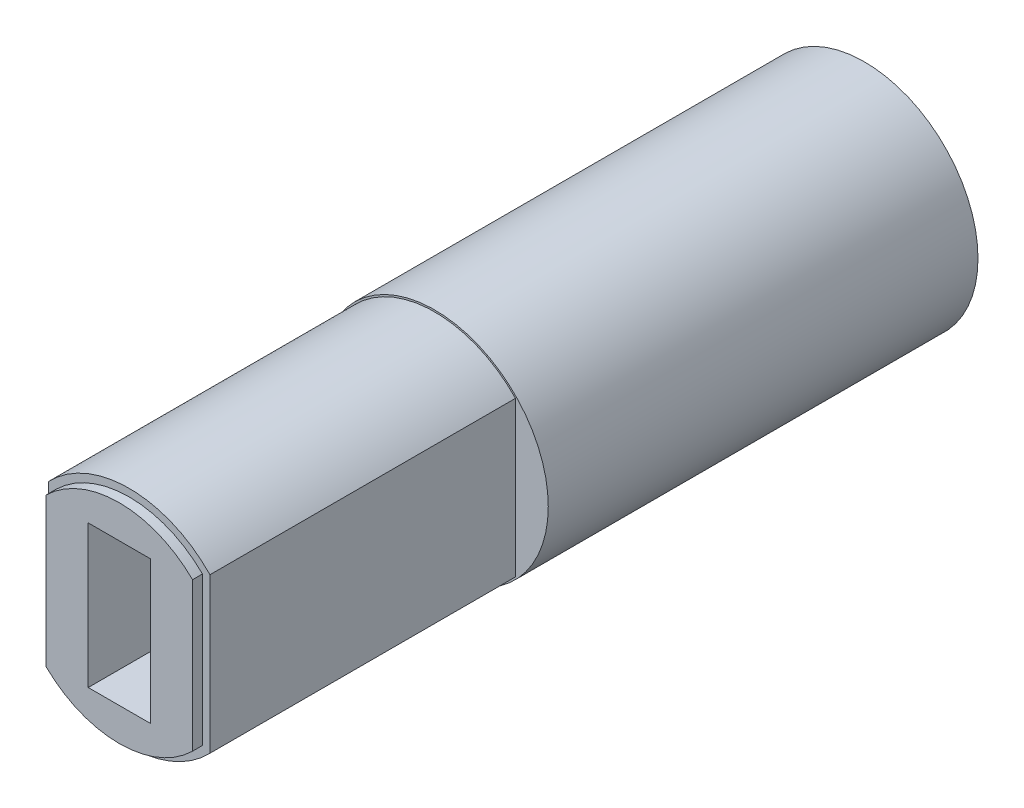
ISO-10303-21;
HEADER;
FILE_DESCRIPTION(('STEP AP214'),'2;1');
FILE_NAME('part.step','',(''),(''),'','','');
FILE_SCHEMA(('AUTOMOTIVE_DESIGN { 1 0 10303 214 1 1 1 1 }'));
ENDSEC;
DATA;
#1=APPLICATION_CONTEXT('core data for automotive mechanical design processes');
#2=APPLICATION_PROTOCOL_DEFINITION('international standard','automotive_design',2000,#1);
#3=PRODUCT_CONTEXT('',#1,'mechanical');
#4=PRODUCT('Part','Part','',(#3));
#5=PRODUCT_RELATED_PRODUCT_CATEGORY('part','',(#4));
#6=PRODUCT_DEFINITION_FORMATION('','',#4);
#7=PRODUCT_DEFINITION_CONTEXT('part definition',#1,'design');
#8=PRODUCT_DEFINITION('design','',#6,#7);
#9=PRODUCT_DEFINITION_SHAPE('','',#8);
#10=(LENGTH_UNIT() NAMED_UNIT(*) SI_UNIT(.MILLI.,.METRE.));
#11=(NAMED_UNIT(*) PLANE_ANGLE_UNIT() SI_UNIT($,.RADIAN.));
#12=(NAMED_UNIT(*) SI_UNIT($,.STERADIAN.) SOLID_ANGLE_UNIT());
#13=UNCERTAINTY_MEASURE_WITH_UNIT(LENGTH_MEASURE(1.E-05),#10,'distance_accuracy_value','');
#14=(GEOMETRIC_REPRESENTATION_CONTEXT(3) GLOBAL_UNCERTAINTY_ASSIGNED_CONTEXT((#13)) GLOBAL_UNIT_ASSIGNED_CONTEXT((#10,
#11,#12)) REPRESENTATION_CONTEXT('',''));
#15=CARTESIAN_POINT('',(0.,0.,0.));
#16=DIRECTION('',(0.,0.,1.));
#17=DIRECTION('',(1.,0.,0.));
#18=AXIS2_PLACEMENT_3D('',#15,#16,#17);
#19=CARTESIAN_POINT('',(0.,0.,71.1018016555873));
#20=DIRECTION('',(0.,0.,-1.));
#21=DIRECTION('',(-1.,0.,0.));
#22=AXIS2_PLACEMENT_3D('',#19,#20,#21);
#23=CYLINDRICAL_SURFACE('',#22,4.5);
#24=CARTESIAN_POINT('',(0.,0.,29.6));
#25=DIRECTION('',(0.,0.,1.));
#26=DIRECTION('',(1.,0.,0.));
#27=AXIS2_PLACEMENT_3D('',#24,#25,#26);
#28=CIRCLE('',#27,4.5);
#29=CARTESIAN_POINT('',(3.25,3.11247489949718,29.6));
#30=VERTEX_POINT('',#29);
#31=CARTESIAN_POINT('',(-3.25,3.11247489949718,29.6));
#32=VERTEX_POINT('',#31);
#33=EDGE_CURVE('E134',#30,#32,#28,.T.);
#34=ORIENTED_EDGE('',*,*,#33,.F.);
#35=DIRECTION('',(0.,0.,-1.));
#36=VECTOR('',#35,1.);
#37=CARTESIAN_POINT('',(3.25,3.11247489949719,71.1018016555873));
#38=LINE('',#37,#36);
#39=CARTESIAN_POINT('',(3.25,3.11247489949718,17.3));
#40=VERTEX_POINT('',#39);
#41=EDGE_CURVE('E145',#30,#40,#38,.T.);
#42=ORIENTED_EDGE('',*,*,#41,.T.);
#43=CARTESIAN_POINT('',(0.,0.,17.3));
#44=DIRECTION('',(0.,0.,1.));
#45=DIRECTION('',(1.,0.,0.));
#46=AXIS2_PLACEMENT_3D('',#43,#44,#45);
#47=CIRCLE('',#46,4.5);
#48=CARTESIAN_POINT('',(-3.25,3.11247489949718,17.3));
#49=VERTEX_POINT('',#48);
#50=EDGE_CURVE('E156',#40,#49,#47,.T.);
#51=ORIENTED_EDGE('',*,*,#50,.T.);
#52=DIRECTION('',(0.,0.,-1.));
#53=VECTOR('',#52,1.);
#54=CARTESIAN_POINT('',(-3.25,3.11247489949718,71.1018016555873));
#55=LINE('',#54,#53);
#56=EDGE_CURVE('E147',#32,#49,#55,.T.);
#57=ORIENTED_EDGE('',*,*,#56,.F.);
#58=EDGE_LOOP('',(#34,#42,#51,#57));
#59=FACE_BOUND('',#58,.T.);
#60=ADVANCED_FACE('F42',(#59),#23,.T.);
#61=CARTESIAN_POINT('',(-3.25,3.11247489949718,71.1018016555873));
#62=DIRECTION('',(1.,0.,0.));
#63=DIRECTION('',(0.,0.,-1.));
#64=AXIS2_PLACEMENT_3D('',#61,#62,#63);
#65=PLANE('',#64);
#66=DIRECTION('',(0.,-1.,0.));
#67=VECTOR('',#66,1.);
#68=CARTESIAN_POINT('',(-3.25,0.,29.6));
#69=LINE('',#68,#67);
#70=CARTESIAN_POINT('',(-3.25000000000001,-3.11247489949718,29.6));
#71=VERTEX_POINT('',#70);
#72=EDGE_CURVE('E149',#32,#71,#69,.T.);
#73=ORIENTED_EDGE('',*,*,#72,.F.);
#74=ORIENTED_EDGE('',*,*,#56,.T.);
#75=DIRECTION('',(0.,-1.,0.));
#76=VECTOR('',#75,1.);
#77=CARTESIAN_POINT('',(-3.25,3.11247489949718,17.3));
#78=LINE('',#77,#76);
#79=CARTESIAN_POINT('',(-3.25,-3.11247489949718,17.3));
#80=VERTEX_POINT('',#79);
#81=EDGE_CURVE('E173',#49,#80,#78,.T.);
#82=ORIENTED_EDGE('',*,*,#81,.T.);
#83=DIRECTION('',(0.,0.,-1.));
#84=VECTOR('',#83,1.);
#85=CARTESIAN_POINT('',(-3.25,-3.11247489949718,71.1018016555872));
#86=LINE('',#85,#84);
#87=EDGE_CURVE('E170',#71,#80,#86,.T.);
#88=ORIENTED_EDGE('',*,*,#87,.F.);
#89=EDGE_LOOP('',(#73,#74,#82,#88));
#90=FACE_BOUND('',#89,.T.);
#91=ADVANCED_FACE('F272',(#90),#65,.F.);
#92=CARTESIAN_POINT('',(0.,0.,71.1018016555873));
#93=DIRECTION('',(0.,0.,-1.));
#94=DIRECTION('',(-1.,0.,0.));
#95=AXIS2_PLACEMENT_3D('',#92,#93,#94);
#96=CYLINDRICAL_SURFACE('',#95,4.5);
#97=CARTESIAN_POINT('',(0.,0.,29.6));
#98=DIRECTION('',(0.,0.,1.));
#99=DIRECTION('',(1.,0.,0.));
#100=AXIS2_PLACEMENT_3D('',#97,#98,#99);
#101=CIRCLE('',#100,4.5);
#102=CARTESIAN_POINT('',(3.25,-3.11247489949718,29.6));
#103=VERTEX_POINT('',#102);
#104=EDGE_CURVE('E58',#71,#103,#101,.T.);
#105=ORIENTED_EDGE('',*,*,#104,.F.);
#106=ORIENTED_EDGE('',*,*,#87,.T.);
#107=CARTESIAN_POINT('',(0.,0.,17.3));
#108=DIRECTION('',(0.,0.,1.));
#109=DIRECTION('',(1.,0.,0.));
#110=AXIS2_PLACEMENT_3D('',#107,#108,#109);
#111=CIRCLE('',#110,4.5);
#112=CARTESIAN_POINT('',(3.25,-3.11247489949718,17.3));
#113=VERTEX_POINT('',#112);
#114=EDGE_CURVE('E169',#80,#113,#111,.T.);
#115=ORIENTED_EDGE('',*,*,#114,.T.);
#116=DIRECTION('',(0.,0.,-1.));
#117=VECTOR('',#116,1.);
#118=CARTESIAN_POINT('',(3.25,-3.11247489949718,71.1018016555873));
#119=LINE('',#118,#117);
#120=EDGE_CURVE('E166',#103,#113,#119,.T.);
#121=ORIENTED_EDGE('',*,*,#120,.F.);
#122=EDGE_LOOP('',(#105,#106,#115,#121));
#123=FACE_BOUND('',#122,.T.);
#124=ADVANCED_FACE('F270',(#123),#96,.T.);
#125=CARTESIAN_POINT('',(3.25,3.11247489949719,71.1018016555873));
#126=DIRECTION('',(-1.,0.,0.));
#127=DIRECTION('',(0.,0.,1.));
#128=AXIS2_PLACEMENT_3D('',#125,#126,#127);
#129=PLANE('',#128);
#130=DIRECTION('',(0.,1.,0.));
#131=VECTOR('',#130,1.);
#132=CARTESIAN_POINT('',(3.25,0.,29.6));
#133=LINE('',#132,#131);
#134=EDGE_CURVE('E130',#103,#30,#133,.T.);
#135=ORIENTED_EDGE('',*,*,#134,.F.);
#136=ORIENTED_EDGE('',*,*,#120,.T.);
#137=DIRECTION('',(0.,1.,0.));
#138=VECTOR('',#137,1.);
#139=CARTESIAN_POINT('',(3.25,3.11247489949718,17.3));
#140=LINE('',#139,#138);
#141=EDGE_CURVE('E154',#113,#40,#140,.T.);
#142=ORIENTED_EDGE('',*,*,#141,.T.);
#143=ORIENTED_EDGE('',*,*,#41,.F.);
#144=EDGE_LOOP('',(#135,#136,#142,#143));
#145=FACE_BOUND('',#144,.T.);
#146=ADVANCED_FACE('F152',(#145),#129,.F.);
#147=CARTESIAN_POINT('',(0.,0.,30.));
#148=DIRECTION('',(0.,0.,1.));
#149=DIRECTION('',(1.,0.,0.));
#150=AXIS2_PLACEMENT_3D('',#147,#148,#149);
#151=PLANE('',#150);
#152=DIRECTION('',(0.,-1.,0.));
#153=VECTOR('',#152,1.);
#154=CARTESIAN_POINT('',(-1.25,2.87,30.));
#155=LINE('',#154,#153);
#156=CARTESIAN_POINT('',(-1.25,2.87,30.));
#157=VERTEX_POINT('',#156);
#158=CARTESIAN_POINT('',(-1.25000000000001,-2.87,30.));
#159=VERTEX_POINT('',#158);
#160=EDGE_CURVE('E207',#157,#159,#155,.T.);
#161=ORIENTED_EDGE('',*,*,#160,.F.);
#162=DIRECTION('',(-1.,0.,0.));
#163=VECTOR('',#162,1.);
#164=CARTESIAN_POINT('',(-1.25,2.87,30.));
#165=LINE('',#164,#163);
#166=CARTESIAN_POINT('',(1.25,2.87,30.));
#167=VERTEX_POINT('',#166);
#168=EDGE_CURVE('E194',#167,#157,#165,.T.);
#169=ORIENTED_EDGE('',*,*,#168,.F.);
#170=DIRECTION('',(0.,1.,0.));
#171=VECTOR('',#170,1.);
#172=CARTESIAN_POINT('',(1.25,2.87,30.));
#173=LINE('',#172,#171);
#174=CARTESIAN_POINT('',(1.25,-2.87,30.));
#175=VERTEX_POINT('',#174);
#176=EDGE_CURVE('E199',#175,#167,#173,.T.);
#177=ORIENTED_EDGE('',*,*,#176,.F.);
#178=DIRECTION('',(1.,0.,0.));
#179=VECTOR('',#178,1.);
#180=CARTESIAN_POINT('',(-1.25000000000001,-2.87,30.));
#181=LINE('',#180,#179);
#182=EDGE_CURVE('E203',#159,#175,#181,.T.);
#183=ORIENTED_EDGE('',*,*,#182,.F.);
#184=EDGE_LOOP('',(#161,#169,#177,#183));
#185=FACE_BOUND('',#184,.T.);
#186=DIRECTION('',(0.,-1.,0.));
#187=VECTOR('',#186,1.);
#188=CARTESIAN_POINT('',(2.94999999999999,0.,30.));
#189=LINE('',#188,#187);
#190=CARTESIAN_POINT('',(2.94999999999999,2.98956518577534,30.));
#191=VERTEX_POINT('',#190);
#192=CARTESIAN_POINT('',(2.94999999999999,-2.98956518577535,30.));
#193=VERTEX_POINT('',#192);
#194=EDGE_CURVE('E244',#191,#193,#189,.T.);
#195=ORIENTED_EDGE('',*,*,#194,.F.);
#196=CARTESIAN_POINT('',(0.,0.,30.));
#197=DIRECTION('',(0.,0.,1.));
#198=DIRECTION('',(1.,0.,0.));
#199=AXIS2_PLACEMENT_3D('',#196,#197,#198);
#200=CIRCLE('',#199,4.2);
#201=CARTESIAN_POINT('',(-2.95000000000001,2.98956518577535,30.));
#202=VERTEX_POINT('',#201);
#203=EDGE_CURVE('E66',#191,#202,#200,.T.);
#204=ORIENTED_EDGE('',*,*,#203,.T.);
#205=DIRECTION('',(0.,-1.,0.));
#206=VECTOR('',#205,1.);
#207=CARTESIAN_POINT('',(-2.95,0.,30.));
#208=LINE('',#207,#206);
#209=CARTESIAN_POINT('',(-2.95,-2.98956518577535,30.));
#210=VERTEX_POINT('',#209);
#211=EDGE_CURVE('E140',#202,#210,#208,.T.);
#212=ORIENTED_EDGE('',*,*,#211,.T.);
#213=CARTESIAN_POINT('',(0.,0.,30.));
#214=DIRECTION('',(0.,0.,1.));
#215=DIRECTION('',(1.,0.,0.));
#216=AXIS2_PLACEMENT_3D('',#213,#214,#215);
#217=CIRCLE('',#216,4.2);
#218=EDGE_CURVE('E240',#210,#193,#217,.T.);
#219=ORIENTED_EDGE('',*,*,#218,.T.);
#220=EDGE_LOOP('',(#195,#204,#212,#219));
#221=FACE_BOUND('',#220,.T.);
#222=ADVANCED_FACE('F284',(#185,#221),#151,.T.);
#223=CARTESIAN_POINT('',(0.,0.,17.3));
#224=DIRECTION('',(0.,0.,-1.));
#225=DIRECTION('',(-1.,0.,0.));
#226=AXIS2_PLACEMENT_3D('',#223,#224,#225);
#227=CYLINDRICAL_SURFACE('',#226,4.57);
#228=CARTESIAN_POINT('',(0.,0.,17.3));
#229=DIRECTION('',(0.,0.,1.));
#230=DIRECTION('',(1.,0.,0.));
#231=AXIS2_PLACEMENT_3D('',#228,#229,#230);
#232=CIRCLE('',#231,4.57);
#233=CARTESIAN_POINT('',(4.57,0.,17.3));
#234=VERTEX_POINT('',#233);
#235=EDGE_CURVE('E12',#234,#234,#232,.T.);
#236=ORIENTED_EDGE('',*,*,#235,.F.);
#237=EDGE_LOOP('',(#236));
#238=FACE_BOUND('',#237,.T.);
#239=CARTESIAN_POINT('',(0.,0.,0.));
#240=DIRECTION('',(0.,0.,1.));
#241=DIRECTION('',(1.,0.,0.));
#242=AXIS2_PLACEMENT_3D('',#239,#240,#241);
#243=CIRCLE('',#242,4.57);
#244=CARTESIAN_POINT('',(4.57,0.,0.));
#245=VERTEX_POINT('',#244);
#246=EDGE_CURVE('E46',#245,#245,#243,.T.);
#247=ORIENTED_EDGE('',*,*,#246,.T.);
#248=EDGE_LOOP('',(#247));
#249=FACE_BOUND('',#248,.T.);
#250=ADVANCED_FACE('F44',(#238,#249),#227,.T.);
#251=CARTESIAN_POINT('',(0.,0.,17.3));
#252=DIRECTION('',(0.,0.,1.));
#253=DIRECTION('',(1.,0.,0.));
#254=AXIS2_PLACEMENT_3D('',#251,#252,#253);
#255=PLANE('',#254);
#256=ORIENTED_EDGE('',*,*,#50,.F.);
#257=ORIENTED_EDGE('',*,*,#141,.F.);
#258=ORIENTED_EDGE('',*,*,#114,.F.);
#259=ORIENTED_EDGE('',*,*,#81,.F.);
#260=EDGE_LOOP('',(#256,#257,#258,#259));
#261=FACE_BOUND('',#260,.T.);
#262=ORIENTED_EDGE('',*,*,#235,.T.);
#263=EDGE_LOOP('',(#262));
#264=FACE_BOUND('',#263,.T.);
#265=ADVANCED_FACE('F275',(#261,#264),#255,.T.);
#266=CARTESIAN_POINT('',(0.,0.,0.));
#267=DIRECTION('',(0.,0.,1.));
#268=DIRECTION('',(1.,0.,0.));
#269=AXIS2_PLACEMENT_3D('',#266,#267,#268);
#270=PLANE('',#269);
#271=DIRECTION('',(-1.,0.,0.));
#272=VECTOR('',#271,1.);
#273=CARTESIAN_POINT('',(-1.25,2.87,0.));
#274=LINE('',#273,#272);
#275=CARTESIAN_POINT('',(1.25,2.87,0.));
#276=VERTEX_POINT('',#275);
#277=CARTESIAN_POINT('',(-1.25,2.87,0.));
#278=VERTEX_POINT('',#277);
#279=EDGE_CURVE('E189',#276,#278,#274,.T.);
#280=ORIENTED_EDGE('',*,*,#279,.T.);
#281=DIRECTION('',(0.,-1.,0.));
#282=VECTOR('',#281,1.);
#283=CARTESIAN_POINT('',(-1.25,2.87,0.));
#284=LINE('',#283,#282);
#285=CARTESIAN_POINT('',(-1.25,-2.87,0.));
#286=VERTEX_POINT('',#285);
#287=EDGE_CURVE('E198',#278,#286,#284,.T.);
#288=ORIENTED_EDGE('',*,*,#287,.T.);
#289=DIRECTION('',(1.,0.,0.));
#290=VECTOR('',#289,1.);
#291=CARTESIAN_POINT('',(-1.25,-2.87,0.));
#292=LINE('',#291,#290);
#293=CARTESIAN_POINT('',(1.25,-2.87,0.));
#294=VERTEX_POINT('',#293);
#295=EDGE_CURVE('E218',#286,#294,#292,.T.);
#296=ORIENTED_EDGE('',*,*,#295,.T.);
#297=DIRECTION('',(0.,1.,0.));
#298=VECTOR('',#297,1.);
#299=CARTESIAN_POINT('',(1.25,2.87,0.));
#300=LINE('',#299,#298);
#301=EDGE_CURVE('E214',#294,#276,#300,.T.);
#302=ORIENTED_EDGE('',*,*,#301,.T.);
#303=EDGE_LOOP('',(#280,#288,#296,#302));
#304=FACE_BOUND('',#303,.T.);
#305=ORIENTED_EDGE('',*,*,#246,.F.);
#306=EDGE_LOOP('',(#305));
#307=FACE_BOUND('',#306,.T.);
#308=ADVANCED_FACE('F278',(#304,#307),#270,.F.);
#309=CARTESIAN_POINT('',(-1.25,2.87,0.));
#310=DIRECTION('',(-1.,0.,0.));
#311=DIRECTION('',(0.,0.,1.));
#312=AXIS2_PLACEMENT_3D('',#309,#310,#311);
#313=PLANE('',#312);
#314=ORIENTED_EDGE('',*,*,#160,.T.);
#315=DIRECTION('',(0.,0.,1.));
#316=VECTOR('',#315,1.);
#317=CARTESIAN_POINT('',(-1.25,-2.87,0.));
#318=LINE('',#317,#316);
#319=EDGE_CURVE('E184',#286,#159,#318,.T.);
#320=ORIENTED_EDGE('',*,*,#319,.F.);
#321=ORIENTED_EDGE('',*,*,#287,.F.);
#322=DIRECTION('',(0.,0.,1.));
#323=VECTOR('',#322,1.);
#324=CARTESIAN_POINT('',(-1.25,2.87,0.));
#325=LINE('',#324,#323);
#326=EDGE_CURVE('E157',#278,#157,#325,.T.);
#327=ORIENTED_EDGE('',*,*,#326,.T.);
#328=EDGE_LOOP('',(#314,#320,#321,#327));
#329=FACE_BOUND('',#328,.T.);
#330=ADVANCED_FACE('F299',(#329),#313,.F.);
#331=CARTESIAN_POINT('',(-1.25,2.87,0.));
#332=DIRECTION('',(0.,1.,0.));
#333=DIRECTION('',(0.,0.,1.));
#334=AXIS2_PLACEMENT_3D('',#331,#332,#333);
#335=PLANE('',#334);
#336=ORIENTED_EDGE('',*,*,#168,.T.);
#337=ORIENTED_EDGE('',*,*,#326,.F.);
#338=ORIENTED_EDGE('',*,*,#279,.F.);
#339=DIRECTION('',(0.,0.,1.));
#340=VECTOR('',#339,1.);
#341=CARTESIAN_POINT('',(1.25,2.87,0.));
#342=LINE('',#341,#340);
#343=EDGE_CURVE('E163',#276,#167,#342,.T.);
#344=ORIENTED_EDGE('',*,*,#343,.T.);
#345=EDGE_LOOP('',(#336,#337,#338,#344));
#346=FACE_BOUND('',#345,.T.);
#347=ADVANCED_FACE('F304',(#346),#335,.F.);
#348=CARTESIAN_POINT('',(1.25,2.87,0.));
#349=DIRECTION('',(1.,0.,0.));
#350=DIRECTION('',(0.,0.,-1.));
#351=AXIS2_PLACEMENT_3D('',#348,#349,#350);
#352=PLANE('',#351);
#353=ORIENTED_EDGE('',*,*,#176,.T.);
#354=ORIENTED_EDGE('',*,*,#343,.F.);
#355=ORIENTED_EDGE('',*,*,#301,.F.);
#356=DIRECTION('',(0.,0.,1.));
#357=VECTOR('',#356,1.);
#358=CARTESIAN_POINT('',(1.25,-2.87,0.));
#359=LINE('',#358,#357);
#360=EDGE_CURVE('E188',#294,#175,#359,.T.);
#361=ORIENTED_EDGE('',*,*,#360,.T.);
#362=EDGE_LOOP('',(#353,#354,#355,#361));
#363=FACE_BOUND('',#362,.T.);
#364=ADVANCED_FACE('F355',(#363),#352,.F.);
#365=CARTESIAN_POINT('',(-1.25,-2.87,0.));
#366=DIRECTION('',(0.,-1.,0.));
#367=DIRECTION('',(0.,0.,-1.));
#368=AXIS2_PLACEMENT_3D('',#365,#366,#367);
#369=PLANE('',#368);
#370=ORIENTED_EDGE('',*,*,#182,.T.);
#371=ORIENTED_EDGE('',*,*,#360,.F.);
#372=ORIENTED_EDGE('',*,*,#295,.F.);
#373=ORIENTED_EDGE('',*,*,#319,.T.);
#374=EDGE_LOOP('',(#370,#371,#372,#373));
#375=FACE_BOUND('',#374,.T.);
#376=ADVANCED_FACE('F352',(#375),#369,.F.);
#377=CARTESIAN_POINT('',(0.,0.,29.6));
#378=DIRECTION('',(0.,0.,1.));
#379=DIRECTION('',(1.,0.,0.));
#380=AXIS2_PLACEMENT_3D('',#377,#378,#379);
#381=CYLINDRICAL_SURFACE('',#380,4.2);
#382=ORIENTED_EDGE('',*,*,#203,.F.);
#383=DIRECTION('',(0.,0.,1.));
#384=VECTOR('',#383,1.);
#385=CARTESIAN_POINT('',(2.94999999999999,2.98956518577534,29.6));
#386=LINE('',#385,#384);
#387=CARTESIAN_POINT('',(2.94999999999999,2.98956518577534,29.6));
#388=VERTEX_POINT('',#387);
#389=EDGE_CURVE('E225',#388,#191,#386,.T.);
#390=ORIENTED_EDGE('',*,*,#389,.F.);
#391=CARTESIAN_POINT('',(0.,0.,29.6));
#392=DIRECTION('',(0.,0.,1.));
#393=DIRECTION('',(1.,0.,0.));
#394=AXIS2_PLACEMENT_3D('',#391,#392,#393);
#395=CIRCLE('',#394,4.2);
#396=CARTESIAN_POINT('',(-2.95000000000001,2.98956518577535,29.6));
#397=VERTEX_POINT('',#396);
#398=EDGE_CURVE('E259',#388,#397,#395,.T.);
#399=ORIENTED_EDGE('',*,*,#398,.T.);
#400=DIRECTION('',(0.,0.,1.));
#401=VECTOR('',#400,1.);
#402=CARTESIAN_POINT('',(-2.95000000000001,2.98956518577535,29.6));
#403=LINE('',#402,#401);
#404=EDGE_CURVE('E210',#397,#202,#403,.T.);
#405=ORIENTED_EDGE('',*,*,#404,.T.);
#406=EDGE_LOOP('',(#382,#390,#399,#405));
#407=FACE_BOUND('',#406,.T.);
#408=ADVANCED_FACE('F332',(#407),#381,.T.);
#409=CARTESIAN_POINT('',(-2.95,0.,29.6));
#410=DIRECTION('',(-1.,0.,0.));
#411=DIRECTION('',(0.,0.,1.));
#412=AXIS2_PLACEMENT_3D('',#409,#410,#411);
#413=PLANE('',#412);
#414=ORIENTED_EDGE('',*,*,#211,.F.);
#415=ORIENTED_EDGE('',*,*,#404,.F.);
#416=DIRECTION('',(0.,-1.,0.));
#417=VECTOR('',#416,1.);
#418=CARTESIAN_POINT('',(-2.95,0.,29.6));
#419=LINE('',#418,#417);
#420=CARTESIAN_POINT('',(-2.95,-2.98956518577535,29.6));
#421=VERTEX_POINT('',#420);
#422=EDGE_CURVE('E229',#397,#421,#419,.T.);
#423=ORIENTED_EDGE('',*,*,#422,.T.);
#424=DIRECTION('',(0.,0.,1.));
#425=VECTOR('',#424,1.);
#426=CARTESIAN_POINT('',(-2.95,-2.98956518577535,29.6));
#427=LINE('',#426,#425);
#428=EDGE_CURVE('E232',#421,#210,#427,.T.);
#429=ORIENTED_EDGE('',*,*,#428,.T.);
#430=EDGE_LOOP('',(#414,#415,#423,#429));
#431=FACE_BOUND('',#430,.T.);
#432=ADVANCED_FACE('F337',(#431),#413,.T.);
#433=CARTESIAN_POINT('',(0.,0.,29.6));
#434=DIRECTION('',(0.,0.,1.));
#435=DIRECTION('',(1.,0.,0.));
#436=AXIS2_PLACEMENT_3D('',#433,#434,#435);
#437=CYLINDRICAL_SURFACE('',#436,4.2);
#438=ORIENTED_EDGE('',*,*,#218,.F.);
#439=ORIENTED_EDGE('',*,*,#428,.F.);
#440=CARTESIAN_POINT('',(0.,0.,29.6));
#441=DIRECTION('',(0.,0.,1.));
#442=DIRECTION('',(1.,0.,0.));
#443=AXIS2_PLACEMENT_3D('',#440,#441,#442);
#444=CIRCLE('',#443,4.2);
#445=CARTESIAN_POINT('',(2.94999999999999,-2.98956518577536,29.6));
#446=VERTEX_POINT('',#445);
#447=EDGE_CURVE('E252',#421,#446,#444,.T.);
#448=ORIENTED_EDGE('',*,*,#447,.T.);
#449=DIRECTION('',(0.,0.,1.));
#450=VECTOR('',#449,1.);
#451=CARTESIAN_POINT('',(2.94999999999999,-2.98956518577536,29.6));
#452=LINE('',#451,#450);
#453=EDGE_CURVE('E228',#446,#193,#452,.T.);
#454=ORIENTED_EDGE('',*,*,#453,.T.);
#455=EDGE_LOOP('',(#438,#439,#448,#454));
#456=FACE_BOUND('',#455,.T.);
#457=ADVANCED_FACE('F339',(#456),#437,.T.);
#458=CARTESIAN_POINT('',(2.94999999999999,0.,29.6));
#459=DIRECTION('',(-1.,0.,0.));
#460=DIRECTION('',(0.,-1.,0.));
#461=AXIS2_PLACEMENT_3D('',#458,#459,#460);
#462=PLANE('',#461);
#463=ORIENTED_EDGE('',*,*,#194,.T.);
#464=ORIENTED_EDGE('',*,*,#453,.F.);
#465=DIRECTION('',(0.,-1.,0.));
#466=VECTOR('',#465,1.);
#467=CARTESIAN_POINT('',(2.94999999999999,0.,29.6));
#468=LINE('',#467,#466);
#469=EDGE_CURVE('E255',#388,#446,#468,.T.);
#470=ORIENTED_EDGE('',*,*,#469,.F.);
#471=ORIENTED_EDGE('',*,*,#389,.T.);
#472=EDGE_LOOP('',(#463,#464,#470,#471));
#473=FACE_BOUND('',#472,.T.);
#474=ADVANCED_FACE('F329',(#473),#462,.F.);
#475=CARTESIAN_POINT('',(0.,0.,29.6));
#476=DIRECTION('',(0.,0.,1.));
#477=DIRECTION('',(1.,0.,0.));
#478=AXIS2_PLACEMENT_3D('',#475,#476,#477);
#479=PLANE('',#478);
#480=ORIENTED_EDGE('',*,*,#134,.T.);
#481=ORIENTED_EDGE('',*,*,#33,.T.);
#482=ORIENTED_EDGE('',*,*,#72,.T.);
#483=ORIENTED_EDGE('',*,*,#104,.T.);
#484=EDGE_LOOP('',(#480,#481,#482,#483));
#485=FACE_BOUND('',#484,.T.);
#486=ORIENTED_EDGE('',*,*,#398,.F.);
#487=ORIENTED_EDGE('',*,*,#469,.T.);
#488=ORIENTED_EDGE('',*,*,#447,.F.);
#489=ORIENTED_EDGE('',*,*,#422,.F.);
#490=EDGE_LOOP('',(#486,#487,#488,#489));
#491=FACE_BOUND('',#490,.T.);
#492=ADVANCED_FACE('F132',(#485,#491),#479,.T.);
#493=CLOSED_SHELL('',(#60,#91,#124,#146,#222,#250,#265,#308,#330,#347,#364,#376,#408,#432,#457,
#474,#492));
#494=MANIFOLD_SOLID_BREP('B2',#493);
#495=ADVANCED_BREP_SHAPE_REPRESENTATION('',(#18,#494),#14);
#496=SHAPE_DEFINITION_REPRESENTATION(#9,#495);
ENDSEC;
END-ISO-10303-21;
